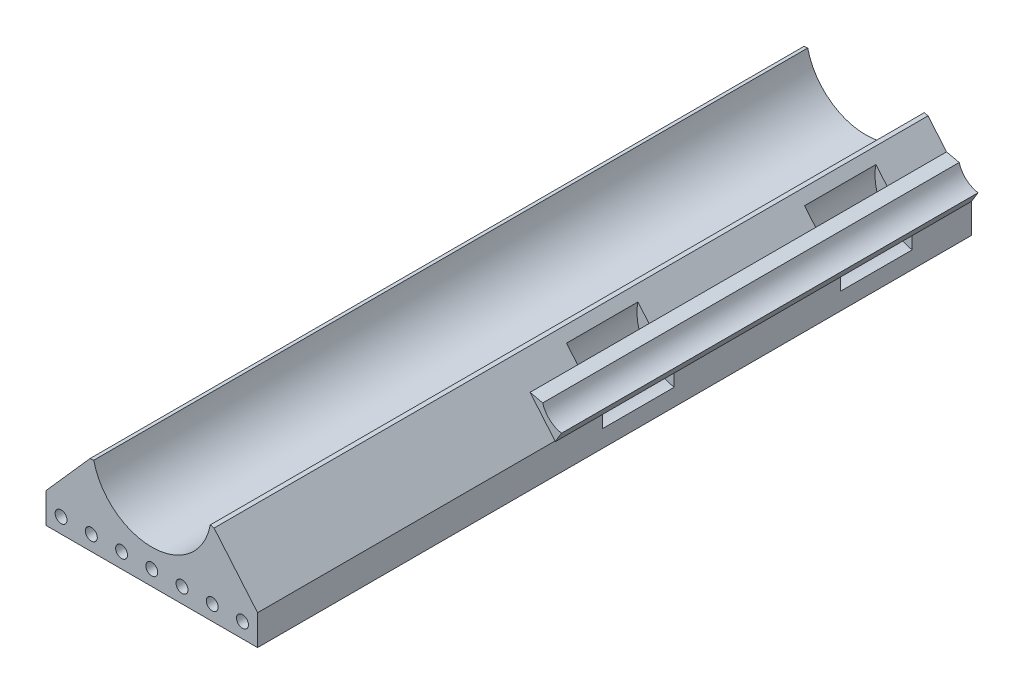
ISO-10303-21;
HEADER;
FILE_DESCRIPTION(('STEP AP214'),'2;1');
FILE_NAME('part.step','',(''),(''),'','','');
FILE_SCHEMA(('AUTOMOTIVE_DESIGN { 1 0 10303 214 1 1 1 1 }'));
ENDSEC;
DATA;
#1=APPLICATION_CONTEXT('core data for automotive mechanical design processes');
#2=APPLICATION_PROTOCOL_DEFINITION('international standard','automotive_design',2000,#1);
#3=PRODUCT_CONTEXT('',#1,'mechanical');
#4=PRODUCT('Part','Part','',(#3));
#5=PRODUCT_RELATED_PRODUCT_CATEGORY('part','',(#4));
#6=PRODUCT_DEFINITION_FORMATION('','',#4);
#7=PRODUCT_DEFINITION_CONTEXT('part definition',#1,'design');
#8=PRODUCT_DEFINITION('design','',#6,#7);
#9=PRODUCT_DEFINITION_SHAPE('','',#8);
#10=(LENGTH_UNIT() NAMED_UNIT(*) SI_UNIT(.MILLI.,.METRE.));
#11=(NAMED_UNIT(*) PLANE_ANGLE_UNIT() SI_UNIT($,.RADIAN.));
#12=(NAMED_UNIT(*) SI_UNIT($,.STERADIAN.) SOLID_ANGLE_UNIT());
#13=UNCERTAINTY_MEASURE_WITH_UNIT(LENGTH_MEASURE(1.E-05),#10,'distance_accuracy_value','');
#14=(GEOMETRIC_REPRESENTATION_CONTEXT(3) GLOBAL_UNCERTAINTY_ASSIGNED_CONTEXT((#13)) GLOBAL_UNIT_ASSIGNED_CONTEXT((#10,
#11,#12)) REPRESENTATION_CONTEXT('',''));
#15=CARTESIAN_POINT('',(0.,0.,0.));
#16=DIRECTION('',(0.,0.,1.));
#17=DIRECTION('',(1.,0.,0.));
#18=AXIS2_PLACEMENT_3D('',#15,#16,#17);
#19=CARTESIAN_POINT('',(2.56876196961471,2.1667272725822,60.));
#20=DIRECTION('',(0.764389099827261,0.644755228024767,0.));
#21=DIRECTION('',(-0.644755228024767,0.764389099827261,0.));
#22=AXIS2_PLACEMENT_3D('',#19,#20,#21);
#23=PLANE('',#22);
#24=DIRECTION('',(0.644755228024768,-0.76438909982726,0.));
#25=VECTOR('',#24,1.);
#26=CARTESIAN_POINT('',(309999.846884956,-367514.884819966,25.));
#27=LINE('',#26,#25);
#28=CARTESIAN_POINT('',(5.85347357839738,-1.72746022781489,25.));
#29=VERTEX_POINT('',#28);
#30=CARTESIAN_POINT('',(6.7900058250499,-2.83776536362719,25.));
#31=VERTEX_POINT('',#30);
#32=EDGE_CURVE('E364',#29,#31,#27,.T.);
#33=ORIENTED_EDGE('',*,*,#32,.T.);
#34=DIRECTION('',(0.,0.,-1.));
#35=VECTOR('',#34,1.);
#36=CARTESIAN_POINT('',(6.7900058250499,-2.83776536362719,35.));
#37=LINE('',#36,#35);
#38=CARTESIAN_POINT('',(6.7900058250499,-2.83776536362719,11.));
#39=VERTEX_POINT('',#38);
#40=EDGE_CURVE('E199',#31,#39,#37,.T.);
#41=ORIENTED_EDGE('',*,*,#40,.T.);
#42=DIRECTION('',(0.644755228024768,-0.76438909982726,0.));
#43=VECTOR('',#42,1.);
#44=CARTESIAN_POINT('',(309999.846884956,-367514.884819966,11.));
#45=LINE('',#44,#43);
#46=CARTESIAN_POINT('',(5.8534735783453,-1.72746022781489,11.));
#47=VERTEX_POINT('',#46);
#48=EDGE_CURVE('E325',#47,#39,#45,.T.);
#49=ORIENTED_EDGE('',*,*,#48,.F.);
#50=DIRECTION('',(0.,0.,1.));
#51=VECTOR('',#50,1.);
#52=CARTESIAN_POINT('',(5.85347357839738,-1.72746022781489,5.));
#53=LINE('',#52,#51);
#54=CARTESIAN_POINT('',(5.85347357839738,-1.72746022781489,5.));
#55=VERTEX_POINT('',#54);
#56=EDGE_CURVE('E317',#55,#47,#53,.T.);
#57=ORIENTED_EDGE('',*,*,#56,.F.);
#58=DIRECTION('',(0.644755228024768,-0.76438909982726,0.));
#59=VECTOR('',#58,1.);
#60=CARTESIAN_POINT('',(309999.846884956,-367514.884819966,5.));
#61=LINE('',#60,#59);
#62=CARTESIAN_POINT('',(6.7900058250499,-2.83776536362719,5.));
#63=VERTEX_POINT('',#62);
#64=EDGE_CURVE('E336',#55,#63,#61,.T.);
#65=ORIENTED_EDGE('',*,*,#64,.T.);
#66=CARTESIAN_POINT('',(6.7900058250499,-2.83776536362719,0.));
#67=VERTEX_POINT('',#66);
#68=EDGE_CURVE('E201',#63,#67,#37,.T.);
#69=ORIENTED_EDGE('',*,*,#68,.T.);
#70=DIRECTION('',(0.644755228024767,-0.764389099827261,0.));
#71=VECTOR('',#70,1.);
#72=CARTESIAN_POINT('',(2.56876196961471,2.1667272725822,0.));
#73=LINE('',#72,#71);
#74=CARTESIAN_POINT('',(5.23403324041858,-0.993083177852738,0.));
#75=VERTEX_POINT('',#74);
#76=EDGE_CURVE('E266',#75,#67,#73,.T.);
#77=ORIENTED_EDGE('',*,*,#76,.F.);
#78=DIRECTION('',(0.,0.,-1.));
#79=VECTOR('',#78,1.);
#80=CARTESIAN_POINT('',(5.23403324041858,-0.993083177852738,60.));
#81=LINE('',#80,#79);
#82=CARTESIAN_POINT('',(5.23403324041858,-0.993083177852738,60.));
#83=VERTEX_POINT('',#82);
#84=EDGE_CURVE('E210',#83,#75,#81,.T.);
#85=ORIENTED_EDGE('',*,*,#84,.F.);
#86=DIRECTION('',(0.644755228024767,-0.764389099827261,0.));
#87=VECTOR('',#86,1.);
#88=CARTESIAN_POINT('',(2.56876196961471,2.1667272725822,60.));
#89=LINE('',#88,#87);
#90=CARTESIAN_POINT('',(8.89,-5.32741195703323,60.));
#91=VERTEX_POINT('',#90);
#92=EDGE_CURVE('E207',#83,#91,#89,.T.);
#93=ORIENTED_EDGE('',*,*,#92,.T.);
#94=DIRECTION('',(0.,0.,-1.));
#95=VECTOR('',#94,1.);
#96=CARTESIAN_POINT('',(8.89,-5.32741195703323,60.));
#97=LINE('',#96,#95);
#98=CARTESIAN_POINT('',(8.89,-5.32741195703323,35.));
#99=VERTEX_POINT('',#98);
#100=EDGE_CURVE('E49',#91,#99,#97,.T.);
#101=ORIENTED_EDGE('',*,*,#100,.T.);
#102=DIRECTION('',(0.644755228024767,-0.764389099827261,0.));
#103=VECTOR('',#102,1.);
#104=CARTESIAN_POINT('',(2.56876196961471,2.1667272725822,35.));
#105=LINE('',#104,#103);
#106=CARTESIAN_POINT('',(6.7900058250499,-2.83776536362719,35.));
#107=VERTEX_POINT('',#106);
#108=EDGE_CURVE('E11',#107,#99,#105,.T.);
#109=ORIENTED_EDGE('',*,*,#108,.F.);
#110=CARTESIAN_POINT('',(6.7900058250499,-2.83776536362719,31.));
#111=VERTEX_POINT('',#110);
#112=EDGE_CURVE('E191',#107,#111,#37,.T.);
#113=ORIENTED_EDGE('',*,*,#112,.T.);
#114=DIRECTION('',(0.644755228024768,-0.76438909982726,0.));
#115=VECTOR('',#114,1.);
#116=CARTESIAN_POINT('',(309999.846884956,-367514.884819966,31.));
#117=LINE('',#116,#115);
#118=CARTESIAN_POINT('',(5.8534735783453,-1.72746022781489,31.));
#119=VERTEX_POINT('',#118);
#120=EDGE_CURVE('E355',#119,#111,#117,.T.);
#121=ORIENTED_EDGE('',*,*,#120,.F.);
#122=DIRECTION('',(0.,0.,1.));
#123=VECTOR('',#122,1.);
#124=CARTESIAN_POINT('',(5.85347357839738,-1.72746022781489,25.));
#125=LINE('',#124,#123);
#126=EDGE_CURVE('E64',#29,#119,#125,.T.);
#127=ORIENTED_EDGE('',*,*,#126,.F.);
#128=EDGE_LOOP('',(#33,#41,#49,#57,#65,#69,#77,#85,#93,#101,#109,#113,#121,#127));
#129=FACE_BOUND('',#128,.T.);
#130=ADVANCED_FACE('F41',(#129),#23,.T.);
#131=CARTESIAN_POINT('',(8.89,0.,60.));
#132=DIRECTION('',(-1.,0.,0.));
#133=DIRECTION('',(0.,0.,1.));
#134=AXIS2_PLACEMENT_3D('',#131,#132,#133);
#135=PLANE('',#134);
#136=DIRECTION('',(0.,1.,0.));
#137=VECTOR('',#136,1.);
#138=CARTESIAN_POINT('',(8.89,0.,0.));
#139=LINE('',#138,#137);
#140=CARTESIAN_POINT('',(8.89,-7.86741195703324,0.));
#141=VERTEX_POINT('',#140);
#142=CARTESIAN_POINT('',(8.89,-5.39033993172947,0.));
#143=VERTEX_POINT('',#142);
#144=EDGE_CURVE('E269',#141,#143,#139,.T.);
#145=ORIENTED_EDGE('',*,*,#144,.T.);
#146=DIRECTION('',(0.,0.,-1.));
#147=VECTOR('',#146,1.);
#148=CARTESIAN_POINT('',(8.89,-5.39033993172947,35.));
#149=LINE('',#148,#147);
#150=CARTESIAN_POINT('',(8.89,-5.39033993172947,5.));
#151=VERTEX_POINT('',#150);
#152=EDGE_CURVE('E374',#151,#143,#149,.T.);
#153=ORIENTED_EDGE('',*,*,#152,.F.);
#154=DIRECTION('',(0.,1.,0.));
#155=VECTOR('',#154,1.);
#156=CARTESIAN_POINT('',(8.89000000051965,-291600.577228365,5.));
#157=LINE('',#156,#155);
#158=CARTESIAN_POINT('',(8.89000000003232,-6.42459297068077,5.));
#159=VERTEX_POINT('',#158);
#160=EDGE_CURVE('E324',#159,#151,#157,.T.);
#161=ORIENTED_EDGE('',*,*,#160,.F.);
#162=DIRECTION('',(0.,0.,1.));
#163=VECTOR('',#162,1.);
#164=CARTESIAN_POINT('',(8.89000000003232,-6.42459297068077,5.));
#165=LINE('',#164,#163);
#166=CARTESIAN_POINT('',(8.89000000003232,-6.42459297068077,11.));
#167=VERTEX_POINT('',#166);
#168=EDGE_CURVE('E272',#159,#167,#165,.T.);
#169=ORIENTED_EDGE('',*,*,#168,.T.);
#170=DIRECTION('',(0.,1.,0.));
#171=VECTOR('',#170,1.);
#172=CARTESIAN_POINT('',(8.89000000051965,-291600.577228365,11.));
#173=LINE('',#172,#171);
#174=CARTESIAN_POINT('',(8.89,-5.39033993172947,11.));
#175=VERTEX_POINT('',#174);
#176=EDGE_CURVE('E331',#167,#175,#173,.T.);
#177=ORIENTED_EDGE('',*,*,#176,.T.);
#178=CARTESIAN_POINT('',(8.89,-5.39033993172947,25.));
#179=VERTEX_POINT('',#178);
#180=EDGE_CURVE('E373',#179,#175,#149,.T.);
#181=ORIENTED_EDGE('',*,*,#180,.F.);
#182=DIRECTION('',(0.,1.,0.));
#183=VECTOR('',#182,1.);
#184=CARTESIAN_POINT('',(8.89000000051965,-291600.577228365,25.));
#185=LINE('',#184,#183);
#186=CARTESIAN_POINT('',(8.89000000003232,-6.42459297068077,25.));
#187=VERTEX_POINT('',#186);
#188=EDGE_CURVE('E354',#187,#179,#185,.T.);
#189=ORIENTED_EDGE('',*,*,#188,.F.);
#190=DIRECTION('',(0.,0.,1.));
#191=VECTOR('',#190,1.);
#192=CARTESIAN_POINT('',(8.89000000003232,-6.42459297068077,25.));
#193=LINE('',#192,#191);
#194=CARTESIAN_POINT('',(8.89000000003232,-6.42459297068077,31.));
#195=VERTEX_POINT('',#194);
#196=EDGE_CURVE('E334',#187,#195,#193,.T.);
#197=ORIENTED_EDGE('',*,*,#196,.T.);
#198=DIRECTION('',(0.,1.,0.));
#199=VECTOR('',#198,1.);
#200=CARTESIAN_POINT('',(8.89000000051965,-291600.577228365,31.));
#201=LINE('',#200,#199);
#202=CARTESIAN_POINT('',(8.89,-5.3903399317399,31.));
#203=VERTEX_POINT('',#202);
#204=EDGE_CURVE('E360',#195,#203,#201,.T.);
#205=ORIENTED_EDGE('',*,*,#204,.T.);
#206=CARTESIAN_POINT('',(8.89,-5.39033993172947,35.));
#207=VERTEX_POINT('',#206);
#208=EDGE_CURVE('E56',#207,#203,#149,.T.);
#209=ORIENTED_EDGE('',*,*,#208,.F.);
#210=DIRECTION('',(0.,1.,0.));
#211=VECTOR('',#210,1.);
#212=CARTESIAN_POINT('',(8.89,0.,35.));
#213=LINE('',#212,#211);
#214=EDGE_CURVE('E198',#207,#99,#213,.T.);
#215=ORIENTED_EDGE('',*,*,#214,.T.);
#216=ORIENTED_EDGE('',*,*,#100,.F.);
#217=DIRECTION('',(0.,1.,0.));
#218=VECTOR('',#217,1.);
#219=CARTESIAN_POINT('',(8.89,0.,60.));
#220=LINE('',#219,#218);
#221=CARTESIAN_POINT('',(8.89,-7.86741195703324,60.));
#222=VERTEX_POINT('',#221);
#223=EDGE_CURVE('E230',#222,#91,#220,.T.);
#224=ORIENTED_EDGE('',*,*,#223,.F.);
#225=DIRECTION('',(0.,0.,-1.));
#226=VECTOR('',#225,1.);
#227=CARTESIAN_POINT('',(8.89,-7.86741195703324,60.));
#228=LINE('',#227,#226);
#229=EDGE_CURVE('E223',#222,#141,#228,.T.);
#230=ORIENTED_EDGE('',*,*,#229,.T.);
#231=EDGE_LOOP('',(#145,#153,#161,#169,#177,#181,#189,#197,#205,#209,#215,#216,#224,#230));
#232=FACE_BOUND('',#231,.T.);
#233=ADVANCED_FACE('F43',(#232),#135,.F.);
#234=CARTESIAN_POINT('',(0.0266361172852631,0.124150275090104,60.));
#235=DIRECTION('',(0.209773701476051,0.977749965057037,0.));
#236=DIRECTION('',(-0.977749965057037,0.209773701476051,0.));
#237=AXIS2_PLACEMENT_3D('',#234,#235,#236);
#238=PLANE('',#237);
#239=DIRECTION('',(0.977749965057037,-0.209773701476051,0.));
#240=VECTOR('',#239,1.);
#241=CARTESIAN_POINT('',(0.0266361172852631,0.124150275090104,0.));
#242=LINE('',#241,#240);
#243=CARTESIAN_POINT('',(4.91380928420098,-0.924379964354641,0.));
#244=VERTEX_POINT('',#243);
#245=EDGE_CURVE('E263',#244,#75,#242,.T.);
#246=ORIENTED_EDGE('',*,*,#245,.F.);
#247=DIRECTION('',(0.,0.,-1.));
#248=VECTOR('',#247,1.);
#249=CARTESIAN_POINT('',(4.91380928420098,-0.924379964354641,60.));
#250=LINE('',#249,#248);
#251=CARTESIAN_POINT('',(4.91380928420098,-0.924379964354641,60.));
#252=VERTEX_POINT('',#251);
#253=EDGE_CURVE('E211',#252,#244,#250,.T.);
#254=ORIENTED_EDGE('',*,*,#253,.F.);
#255=DIRECTION('',(0.977749965057037,-0.209773701476051,0.));
#256=VECTOR('',#255,1.);
#257=CARTESIAN_POINT('',(0.0266361172852631,0.124150275090104,60.));
#258=LINE('',#257,#256);
#259=EDGE_CURVE('E306',#252,#83,#258,.T.);
#260=ORIENTED_EDGE('',*,*,#259,.T.);
#261=ORIENTED_EDGE('',*,*,#84,.T.);
#262=EDGE_LOOP('',(#246,#254,#260,#261));
#263=FACE_BOUND('',#262,.T.);
#264=ADVANCED_FACE('F433',(#263),#238,.T.);
#265=CARTESIAN_POINT('',(0.,0.,60.));
#266=DIRECTION('',(0.,0.,-1.));
#267=DIRECTION('',(-1.,0.,0.));
#268=AXIS2_PLACEMENT_3D('',#265,#266,#267);
#269=CYLINDRICAL_SURFACE('',#268,5.);
#270=CARTESIAN_POINT('',(0.,0.,0.));
#271=DIRECTION('',(0.,0.,1.));
#272=DIRECTION('',(1.,0.,0.));
#273=AXIS2_PLACEMENT_3D('',#270,#271,#272);
#274=CIRCLE('',#273,5.);
#275=CARTESIAN_POINT('',(-4.87518967537907,-1.11019170825464,0.));
#276=VERTEX_POINT('',#275);
#277=EDGE_CURVE('E260',#276,#244,#274,.T.);
#278=ORIENTED_EDGE('',*,*,#277,.F.);
#279=DIRECTION('',(0.,0.,-1.));
#280=VECTOR('',#279,1.);
#281=CARTESIAN_POINT('',(-4.87518967537907,-1.11019170825464,60.));
#282=LINE('',#281,#280);
#283=CARTESIAN_POINT('',(-4.87518967537907,-1.11019170825464,60.));
#284=VERTEX_POINT('',#283);
#285=EDGE_CURVE('E215',#284,#276,#282,.T.);
#286=ORIENTED_EDGE('',*,*,#285,.F.);
#287=CARTESIAN_POINT('',(0.,0.,60.));
#288=DIRECTION('',(0.,0.,1.));
#289=DIRECTION('',(1.,0.,0.));
#290=AXIS2_PLACEMENT_3D('',#287,#288,#289);
#291=CIRCLE('',#290,5.);
#292=EDGE_CURVE('E303',#284,#252,#291,.T.);
#293=ORIENTED_EDGE('',*,*,#292,.T.);
#294=ORIENTED_EDGE('',*,*,#253,.T.);
#295=EDGE_LOOP('',(#278,#286,#293,#294));
#296=FACE_BOUND('',#295,.T.);
#297=ADVANCED_FACE('F429',(#296),#269,.F.);
#298=CARTESIAN_POINT('',(0.0579770681921691,-0.406365014776598,60.));
#299=DIRECTION('',(-0.141242111976336,0.989975083426075,0.));
#300=DIRECTION('',(-0.989975083426075,-0.141242111976336,0.));
#301=AXIS2_PLACEMENT_3D('',#298,#299,#300);
#302=PLANE('',#301);
#303=DIRECTION('',(0.989975083426075,0.141242111976336,0.));
#304=VECTOR('',#303,1.);
#305=CARTESIAN_POINT('',(0.0579770681921691,-0.406365014776598,0.));
#306=LINE('',#305,#304);
#307=CARTESIAN_POINT('',(-5.20034939883361,-1.15658302338898,0.));
#308=VERTEX_POINT('',#307);
#309=EDGE_CURVE('E257',#308,#276,#306,.T.);
#310=ORIENTED_EDGE('',*,*,#309,.F.);
#311=DIRECTION('',(0.,0.,-1.));
#312=VECTOR('',#311,1.);
#313=CARTESIAN_POINT('',(-5.20034939883361,-1.15658302338898,60.));
#314=LINE('',#313,#312);
#315=CARTESIAN_POINT('',(-5.20034939883361,-1.15658302338898,60.));
#316=VERTEX_POINT('',#315);
#317=EDGE_CURVE('E217',#316,#308,#314,.T.);
#318=ORIENTED_EDGE('',*,*,#317,.F.);
#319=DIRECTION('',(0.989975083426075,0.141242111976336,0.));
#320=VECTOR('',#319,1.);
#321=CARTESIAN_POINT('',(0.0579770681921691,-0.406365014776598,60.));
#322=LINE('',#321,#320);
#323=EDGE_CURVE('E300',#316,#284,#322,.T.);
#324=ORIENTED_EDGE('',*,*,#323,.T.);
#325=ORIENTED_EDGE('',*,*,#285,.T.);
#326=EDGE_LOOP('',(#310,#318,#324,#325));
#327=FACE_BOUND('',#326,.T.);
#328=ADVANCED_FACE('F424',(#327),#302,.T.);
#329=CARTESIAN_POINT('',(-2.34335136006175,2.07300464534789,60.));
#330=DIRECTION('',(0.748990220795016,-0.662581051006919,0.));
#331=DIRECTION('',(0.662581051006919,0.748990220795016,0.));
#332=AXIS2_PLACEMENT_3D('',#329,#330,#331);
#333=PLANE('',#332);
#334=DIRECTION('',(-0.662581051006919,-0.748990220795016,0.));
#335=VECTOR('',#334,1.);
#336=CARTESIAN_POINT('',(-2.34335136006175,2.07300464534789,0.));
#337=LINE('',#336,#335);
#338=CARTESIAN_POINT('',(-8.89,-5.32741195703323,0.));
#339=VERTEX_POINT('',#338);
#340=EDGE_CURVE('E254',#308,#339,#337,.T.);
#341=ORIENTED_EDGE('',*,*,#340,.T.);
#342=DIRECTION('',(0.,0.,-1.));
#343=VECTOR('',#342,1.);
#344=CARTESIAN_POINT('',(-8.89,-5.32741195703323,60.));
#345=LINE('',#344,#343);
#346=CARTESIAN_POINT('',(-8.89,-5.32741195703323,60.));
#347=VERTEX_POINT('',#346);
#348=EDGE_CURVE('E219',#347,#339,#345,.T.);
#349=ORIENTED_EDGE('',*,*,#348,.F.);
#350=DIRECTION('',(-0.662581051006919,-0.748990220795016,0.));
#351=VECTOR('',#350,1.);
#352=CARTESIAN_POINT('',(-2.34335136006175,2.07300464534789,60.));
#353=LINE('',#352,#351);
#354=EDGE_CURVE('E298',#316,#347,#353,.T.);
#355=ORIENTED_EDGE('',*,*,#354,.F.);
#356=ORIENTED_EDGE('',*,*,#317,.T.);
#357=EDGE_LOOP('',(#341,#349,#355,#356));
#358=FACE_BOUND('',#357,.T.);
#359=ADVANCED_FACE('F421',(#358),#333,.F.);
#360=CARTESIAN_POINT('',(-8.89,0.,60.));
#361=DIRECTION('',(-1.,0.,0.));
#362=DIRECTION('',(0.,0.,1.));
#363=AXIS2_PLACEMENT_3D('',#360,#361,#362);
#364=PLANE('',#363);
#365=DIRECTION('',(0.,1.,0.));
#366=VECTOR('',#365,1.);
#367=CARTESIAN_POINT('',(-8.89,0.,0.));
#368=LINE('',#367,#366);
#369=CARTESIAN_POINT('',(-8.89,-7.86741195703324,0.));
#370=VERTEX_POINT('',#369);
#371=EDGE_CURVE('E251',#370,#339,#368,.T.);
#372=ORIENTED_EDGE('',*,*,#371,.F.);
#373=DIRECTION('',(0.,0.,-1.));
#374=VECTOR('',#373,1.);
#375=CARTESIAN_POINT('',(-8.89,-7.86741195703324,60.));
#376=LINE('',#375,#374);
#377=CARTESIAN_POINT('',(-8.89,-7.86741195703324,60.));
#378=VERTEX_POINT('',#377);
#379=EDGE_CURVE('E221',#378,#370,#376,.T.);
#380=ORIENTED_EDGE('',*,*,#379,.F.);
#381=DIRECTION('',(0.,1.,0.));
#382=VECTOR('',#381,1.);
#383=CARTESIAN_POINT('',(-8.89,0.,60.));
#384=LINE('',#383,#382);
#385=EDGE_CURVE('E295',#378,#347,#384,.T.);
#386=ORIENTED_EDGE('',*,*,#385,.T.);
#387=ORIENTED_EDGE('',*,*,#348,.T.);
#388=EDGE_LOOP('',(#372,#380,#386,#387));
#389=FACE_BOUND('',#388,.T.);
#390=ADVANCED_FACE('F417',(#389),#364,.T.);
#391=CARTESIAN_POINT('',(-5.08,-6.59741195703324,60.));
#392=DIRECTION('',(0.,0.,-1.));
#393=DIRECTION('',(-1.,0.,0.));
#394=AXIS2_PLACEMENT_3D('',#391,#392,#393);
#395=CYLINDRICAL_SURFACE('',#394,0.500000000000001);
#396=CARTESIAN_POINT('',(-5.08,-6.59741195703324,60.));
#397=DIRECTION('',(0.,0.,1.));
#398=DIRECTION('',(1.,0.,0.));
#399=AXIS2_PLACEMENT_3D('',#396,#397,#398);
#400=CIRCLE('',#399,0.500000000000001);
#401=CARTESIAN_POINT('',(-4.58,-6.59741195703324,60.));
#402=VERTEX_POINT('',#401);
#403=EDGE_CURVE('E275',#402,#402,#400,.T.);
#404=ORIENTED_EDGE('',*,*,#403,.T.);
#405=EDGE_LOOP('',(#404));
#406=FACE_BOUND('',#405,.T.);
#407=CARTESIAN_POINT('',(-5.08,-6.59741195703324,0.));
#408=DIRECTION('',(0.,0.,1.));
#409=DIRECTION('',(1.,0.,0.));
#410=AXIS2_PLACEMENT_3D('',#407,#408,#409);
#411=CIRCLE('',#410,0.500000000000001);
#412=CARTESIAN_POINT('',(-4.58,-6.59741195703324,0.));
#413=VERTEX_POINT('',#412);
#414=EDGE_CURVE('E231',#413,#413,#411,.T.);
#415=ORIENTED_EDGE('',*,*,#414,.F.);
#416=EDGE_LOOP('',(#415));
#417=FACE_BOUND('',#416,.T.);
#418=ADVANCED_FACE('F477',(#406,#417),#395,.F.);
#419=CARTESIAN_POINT('',(-2.54,-6.59741195703324,60.));
#420=DIRECTION('',(0.,0.,-1.));
#421=DIRECTION('',(-1.,0.,0.));
#422=AXIS2_PLACEMENT_3D('',#419,#420,#421);
#423=CYLINDRICAL_SURFACE('',#422,0.5);
#424=CARTESIAN_POINT('',(-2.54,-6.59741195703324,60.));
#425=DIRECTION('',(0.,0.,1.));
#426=DIRECTION('',(1.,0.,0.));
#427=AXIS2_PLACEMENT_3D('',#424,#425,#426);
#428=CIRCLE('',#427,0.5);
#429=CARTESIAN_POINT('',(-2.04,-6.59741195703324,60.));
#430=VERTEX_POINT('',#429);
#431=EDGE_CURVE('E278',#430,#430,#428,.T.);
#432=ORIENTED_EDGE('',*,*,#431,.T.);
#433=EDGE_LOOP('',(#432));
#434=FACE_BOUND('',#433,.T.);
#435=CARTESIAN_POINT('',(-2.54,-6.59741195703324,0.));
#436=DIRECTION('',(0.,0.,1.));
#437=DIRECTION('',(1.,0.,0.));
#438=AXIS2_PLACEMENT_3D('',#435,#436,#437);
#439=CIRCLE('',#438,0.5);
#440=CARTESIAN_POINT('',(-2.04,-6.59741195703324,0.));
#441=VERTEX_POINT('',#440);
#442=EDGE_CURVE('E234',#441,#441,#439,.T.);
#443=ORIENTED_EDGE('',*,*,#442,.F.);
#444=EDGE_LOOP('',(#443));
#445=FACE_BOUND('',#444,.T.);
#446=ADVANCED_FACE('F496',(#434,#445),#423,.F.);
#447=CARTESIAN_POINT('',(0.,-6.59741195703324,60.));
#448=DIRECTION('',(0.,0.,-1.));
#449=DIRECTION('',(-1.,0.,0.));
#450=AXIS2_PLACEMENT_3D('',#447,#448,#449);
#451=CYLINDRICAL_SURFACE('',#450,0.500000000000001);
#452=CARTESIAN_POINT('',(0.,-6.59741195703324,60.));
#453=DIRECTION('',(0.,0.,1.));
#454=DIRECTION('',(1.,0.,0.));
#455=AXIS2_PLACEMENT_3D('',#452,#453,#454);
#456=CIRCLE('',#455,0.500000000000001);
#457=CARTESIAN_POINT('',(0.500000000000001,-6.59741195703324,60.));
#458=VERTEX_POINT('',#457);
#459=EDGE_CURVE('E281',#458,#458,#456,.T.);
#460=ORIENTED_EDGE('',*,*,#459,.T.);
#461=EDGE_LOOP('',(#460));
#462=FACE_BOUND('',#461,.T.);
#463=CARTESIAN_POINT('',(0.,-6.59741195703324,0.));
#464=DIRECTION('',(0.,0.,1.));
#465=DIRECTION('',(1.,0.,0.));
#466=AXIS2_PLACEMENT_3D('',#463,#464,#465);
#467=CIRCLE('',#466,0.500000000000001);
#468=CARTESIAN_POINT('',(0.500000000000001,-6.59741195703324,0.));
#469=VERTEX_POINT('',#468);
#470=EDGE_CURVE('E237',#469,#469,#467,.T.);
#471=ORIENTED_EDGE('',*,*,#470,.F.);
#472=EDGE_LOOP('',(#471));
#473=FACE_BOUND('',#472,.T.);
#474=ADVANCED_FACE('F492',(#462,#473),#451,.F.);
#475=CARTESIAN_POINT('',(2.54,-6.59741195703324,60.));
#476=DIRECTION('',(0.,0.,-1.));
#477=DIRECTION('',(-1.,0.,0.));
#478=AXIS2_PLACEMENT_3D('',#475,#476,#477);
#479=CYLINDRICAL_SURFACE('',#478,0.5);
#480=CARTESIAN_POINT('',(2.54,-6.59741195703324,60.));
#481=DIRECTION('',(0.,0.,1.));
#482=DIRECTION('',(1.,0.,0.));
#483=AXIS2_PLACEMENT_3D('',#480,#481,#482);
#484=CIRCLE('',#483,0.5);
#485=CARTESIAN_POINT('',(3.04,-6.59741195703324,60.));
#486=VERTEX_POINT('',#485);
#487=EDGE_CURVE('E284',#486,#486,#484,.T.);
#488=ORIENTED_EDGE('',*,*,#487,.T.);
#489=EDGE_LOOP('',(#488));
#490=FACE_BOUND('',#489,.T.);
#491=CARTESIAN_POINT('',(2.54,-6.59741195703324,0.));
#492=DIRECTION('',(0.,0.,1.));
#493=DIRECTION('',(1.,0.,0.));
#494=AXIS2_PLACEMENT_3D('',#491,#492,#493);
#495=CIRCLE('',#494,0.5);
#496=CARTESIAN_POINT('',(3.04,-6.59741195703324,0.));
#497=VERTEX_POINT('',#496);
#498=EDGE_CURVE('E240',#497,#497,#495,.T.);
#499=ORIENTED_EDGE('',*,*,#498,.F.);
#500=EDGE_LOOP('',(#499));
#501=FACE_BOUND('',#500,.T.);
#502=ADVANCED_FACE('F488',(#490,#501),#479,.F.);
#503=CARTESIAN_POINT('',(5.08,-6.59741195703324,60.));
#504=DIRECTION('',(0.,0.,-1.));
#505=DIRECTION('',(-1.,0.,0.));
#506=AXIS2_PLACEMENT_3D('',#503,#504,#505);
#507=CYLINDRICAL_SURFACE('',#506,0.500000000000001);
#508=CARTESIAN_POINT('',(5.08,-6.59741195703324,60.));
#509=DIRECTION('',(0.,0.,1.));
#510=DIRECTION('',(1.,0.,0.));
#511=AXIS2_PLACEMENT_3D('',#508,#509,#510);
#512=CIRCLE('',#511,0.500000000000001);
#513=CARTESIAN_POINT('',(5.58,-6.59741195703324,60.));
#514=VERTEX_POINT('',#513);
#515=EDGE_CURVE('E287',#514,#514,#512,.T.);
#516=ORIENTED_EDGE('',*,*,#515,.T.);
#517=EDGE_LOOP('',(#516));
#518=FACE_BOUND('',#517,.T.);
#519=CARTESIAN_POINT('',(5.08,-6.59741195703324,0.));
#520=DIRECTION('',(0.,0.,1.));
#521=DIRECTION('',(1.,0.,0.));
#522=AXIS2_PLACEMENT_3D('',#519,#520,#521);
#523=CIRCLE('',#522,0.500000000000001);
#524=CARTESIAN_POINT('',(5.58,-6.59741195703324,0.));
#525=VERTEX_POINT('',#524);
#526=EDGE_CURVE('E243',#525,#525,#523,.T.);
#527=ORIENTED_EDGE('',*,*,#526,.F.);
#528=EDGE_LOOP('',(#527));
#529=FACE_BOUND('',#528,.T.);
#530=ADVANCED_FACE('F484',(#518,#529),#507,.F.);
#531=CARTESIAN_POINT('',(7.62,-6.59741195703324,60.));
#532=DIRECTION('',(0.,0.,-1.));
#533=DIRECTION('',(-1.,0.,0.));
#534=AXIS2_PLACEMENT_3D('',#531,#532,#533);
#535=CYLINDRICAL_SURFACE('',#534,0.500000000000001);
#536=CARTESIAN_POINT('',(7.62,-6.59741195703324,60.));
#537=DIRECTION('',(0.,0.,1.));
#538=DIRECTION('',(1.,0.,0.));
#539=AXIS2_PLACEMENT_3D('',#536,#537,#538);
#540=CIRCLE('',#539,0.500000000000001);
#541=CARTESIAN_POINT('',(8.12,-6.59741195703324,60.));
#542=VERTEX_POINT('',#541);
#543=EDGE_CURVE('E290',#542,#542,#540,.T.);
#544=ORIENTED_EDGE('',*,*,#543,.T.);
#545=EDGE_LOOP('',(#544));
#546=FACE_BOUND('',#545,.T.);
#547=CARTESIAN_POINT('',(7.62,-6.59741195703324,0.));
#548=DIRECTION('',(0.,0.,1.));
#549=DIRECTION('',(1.,0.,0.));
#550=AXIS2_PLACEMENT_3D('',#547,#548,#549);
#551=CIRCLE('',#550,0.500000000000001);
#552=CARTESIAN_POINT('',(8.12,-6.59741195703324,0.));
#553=VERTEX_POINT('',#552);
#554=EDGE_CURVE('E246',#553,#553,#551,.T.);
#555=ORIENTED_EDGE('',*,*,#554,.F.);
#556=EDGE_LOOP('',(#555));
#557=FACE_BOUND('',#556,.T.);
#558=ADVANCED_FACE('F481',(#546,#557),#535,.F.);
#559=CARTESIAN_POINT('',(0.,-7.86741195703324,60.));
#560=DIRECTION('',(0.,1.,0.));
#561=DIRECTION('',(0.,0.,1.));
#562=AXIS2_PLACEMENT_3D('',#559,#560,#561);
#563=PLANE('',#562);
#564=DIRECTION('',(1.,0.,0.));
#565=VECTOR('',#564,1.);
#566=CARTESIAN_POINT('',(0.,-7.86741195703324,0.));
#567=LINE('',#566,#565);
#568=EDGE_CURVE('E249',#370,#141,#567,.T.);
#569=ORIENTED_EDGE('',*,*,#568,.T.);
#570=ORIENTED_EDGE('',*,*,#229,.F.);
#571=DIRECTION('',(1.,0.,0.));
#572=VECTOR('',#571,1.);
#573=CARTESIAN_POINT('',(0.,-7.86741195703324,60.));
#574=LINE('',#573,#572);
#575=EDGE_CURVE('E293',#378,#222,#574,.T.);
#576=ORIENTED_EDGE('',*,*,#575,.F.);
#577=ORIENTED_EDGE('',*,*,#379,.T.);
#578=EDGE_LOOP('',(#569,#570,#576,#577));
#579=FACE_BOUND('',#578,.T.);
#580=ADVANCED_FACE('F412',(#579),#563,.F.);
#581=CARTESIAN_POINT('',(-7.62,-6.59741195703324,60.));
#582=DIRECTION('',(0.,0.,-1.));
#583=DIRECTION('',(-1.,0.,0.));
#584=AXIS2_PLACEMENT_3D('',#581,#582,#583);
#585=CYLINDRICAL_SURFACE('',#584,0.500000000000001);
#586=CARTESIAN_POINT('',(-7.62,-6.59741195703324,60.));
#587=DIRECTION('',(0.,0.,1.));
#588=DIRECTION('',(1.,0.,0.));
#589=AXIS2_PLACEMENT_3D('',#586,#587,#588);
#590=CIRCLE('',#589,0.500000000000001);
#591=CARTESIAN_POINT('',(-7.12,-6.59741195703324,60.));
#592=VERTEX_POINT('',#591);
#593=EDGE_CURVE('E226',#592,#592,#590,.T.);
#594=ORIENTED_EDGE('',*,*,#593,.T.);
#595=EDGE_LOOP('',(#594));
#596=FACE_BOUND('',#595,.T.);
#597=CARTESIAN_POINT('',(-7.62,-6.59741195703324,0.));
#598=DIRECTION('',(0.,0.,1.));
#599=DIRECTION('',(1.,0.,0.));
#600=AXIS2_PLACEMENT_3D('',#597,#598,#599);
#601=CIRCLE('',#600,0.500000000000001);
#602=CARTESIAN_POINT('',(-7.12,-6.59741195703324,0.));
#603=VERTEX_POINT('',#602);
#604=EDGE_CURVE('E227',#603,#603,#601,.T.);
#605=ORIENTED_EDGE('',*,*,#604,.F.);
#606=EDGE_LOOP('',(#605));
#607=FACE_BOUND('',#606,.T.);
#608=ADVANCED_FACE('F480',(#596,#607),#585,.F.);
#609=CARTESIAN_POINT('',(0.,0.,60.));
#610=DIRECTION('',(0.,0.,1.));
#611=DIRECTION('',(1.,0.,0.));
#612=AXIS2_PLACEMENT_3D('',#609,#610,#611);
#613=PLANE('',#612);
#614=ORIENTED_EDGE('',*,*,#223,.T.);
#615=ORIENTED_EDGE('',*,*,#92,.F.);
#616=ORIENTED_EDGE('',*,*,#259,.F.);
#617=ORIENTED_EDGE('',*,*,#292,.F.);
#618=ORIENTED_EDGE('',*,*,#323,.F.);
#619=ORIENTED_EDGE('',*,*,#354,.T.);
#620=ORIENTED_EDGE('',*,*,#385,.F.);
#621=ORIENTED_EDGE('',*,*,#575,.T.);
#622=EDGE_LOOP('',(#614,#615,#616,#617,#618,#619,#620,#621));
#623=FACE_BOUND('',#622,.T.);
#624=ORIENTED_EDGE('',*,*,#543,.F.);
#625=EDGE_LOOP('',(#624));
#626=FACE_BOUND('',#625,.T.);
#627=ORIENTED_EDGE('',*,*,#515,.F.);
#628=EDGE_LOOP('',(#627));
#629=FACE_BOUND('',#628,.T.);
#630=ORIENTED_EDGE('',*,*,#487,.F.);
#631=EDGE_LOOP('',(#630));
#632=FACE_BOUND('',#631,.T.);
#633=ORIENTED_EDGE('',*,*,#459,.F.);
#634=EDGE_LOOP('',(#633));
#635=FACE_BOUND('',#634,.T.);
#636=ORIENTED_EDGE('',*,*,#431,.F.);
#637=EDGE_LOOP('',(#636));
#638=FACE_BOUND('',#637,.T.);
#639=ORIENTED_EDGE('',*,*,#403,.F.);
#640=EDGE_LOOP('',(#639));
#641=FACE_BOUND('',#640,.T.);
#642=ORIENTED_EDGE('',*,*,#593,.F.);
#643=EDGE_LOOP('',(#642));
#644=FACE_BOUND('',#643,.T.);
#645=ADVANCED_FACE('F458',(#623,#626,#629,#632,#635,#638,#641,#644),#613,.T.);
#646=CARTESIAN_POINT('',(0.,0.,0.));
#647=DIRECTION('',(0.,0.,1.));
#648=DIRECTION('',(1.,0.,0.));
#649=AXIS2_PLACEMENT_3D('',#646,#647,#648);
#650=PLANE('',#649);
#651=ORIENTED_EDGE('',*,*,#76,.T.);
#652=DIRECTION('',(-0.975298391336973,0.220891484343588,0.));
#653=VECTOR('',#652,1.);
#654=CARTESIAN_POINT('',(-0.28004921223437,-1.23649649509585,0.));
#655=LINE('',#654,#653);
#656=CARTESIAN_POINT('',(7.85201112602312,-3.07829475380813,0.));
#657=VERTEX_POINT('',#656);
#658=EDGE_CURVE('E384',#657,#67,#655,.T.);
#659=ORIENTED_EDGE('',*,*,#658,.F.);
#660=CARTESIAN_POINT('',(9.77348749490076,-2.52338164002832,0.));
#661=DIRECTION('',(0.,0.,1.));
#662=DIRECTION('',(1.,0.,0.));
#663=AXIS2_PLACEMENT_3D('',#660,#661,#662);
#664=CIRCLE('',#663,2.);
#665=CARTESIAN_POINT('',(9.43236554855596,-4.4940758876786,0.));
#666=VERTEX_POINT('',#665);
#667=EDGE_CURVE('E188',#657,#666,#664,.T.);
#668=ORIENTED_EDGE('',*,*,#667,.T.);
#669=DIRECTION('',(-0.517725788052273,-0.855546613800589,0.));
#670=VECTOR('',#669,1.);
#671=CARTESIAN_POINT('',(8.89471380013056,-5.38255033377452,0.));
#672=LINE('',#671,#670);
#673=EDGE_CURVE('E381',#666,#143,#672,.T.);
#674=ORIENTED_EDGE('',*,*,#673,.T.);
#675=ORIENTED_EDGE('',*,*,#144,.F.);
#676=ORIENTED_EDGE('',*,*,#568,.F.);
#677=ORIENTED_EDGE('',*,*,#371,.T.);
#678=ORIENTED_EDGE('',*,*,#340,.F.);
#679=ORIENTED_EDGE('',*,*,#309,.T.);
#680=ORIENTED_EDGE('',*,*,#277,.T.);
#681=ORIENTED_EDGE('',*,*,#245,.T.);
#682=EDGE_LOOP('',(#651,#659,#668,#674,#675,#676,#677,#678,#679,#680,#681));
#683=FACE_BOUND('',#682,.T.);
#684=ORIENTED_EDGE('',*,*,#554,.T.);
#685=EDGE_LOOP('',(#684));
#686=FACE_BOUND('',#685,.T.);
#687=ORIENTED_EDGE('',*,*,#526,.T.);
#688=EDGE_LOOP('',(#687));
#689=FACE_BOUND('',#688,.T.);
#690=ORIENTED_EDGE('',*,*,#498,.T.);
#691=EDGE_LOOP('',(#690));
#692=FACE_BOUND('',#691,.T.);
#693=ORIENTED_EDGE('',*,*,#470,.T.);
#694=EDGE_LOOP('',(#693));
#695=FACE_BOUND('',#694,.T.);
#696=ORIENTED_EDGE('',*,*,#442,.T.);
#697=EDGE_LOOP('',(#696));
#698=FACE_BOUND('',#697,.T.);
#699=ORIENTED_EDGE('',*,*,#414,.T.);
#700=EDGE_LOOP('',(#699));
#701=FACE_BOUND('',#700,.T.);
#702=ORIENTED_EDGE('',*,*,#604,.T.);
#703=EDGE_LOOP('',(#702));
#704=FACE_BOUND('',#703,.T.);
#705=ADVANCED_FACE('F404',(#683,#686,#689,#692,#695,#698,#701,#704),#650,.F.);
#706=CARTESIAN_POINT('',(9.77348749490076,-2.52338164002832,5.));
#707=DIRECTION('',(0.,0.,1.));
#708=DIRECTION('',(1.,0.,0.));
#709=AXIS2_PLACEMENT_3D('',#706,#707,#708);
#710=CYLINDRICAL_SURFACE('',#709,4.);
#711=CARTESIAN_POINT('',(9.77348749490076,-2.52338164002832,11.));
#712=DIRECTION('',(0.,0.,-1.));
#713=DIRECTION('',(-1.,0.,0.));
#714=AXIS2_PLACEMENT_3D('',#711,#712,#713);
#715=CIRCLE('',#714,4.);
#716=EDGE_CURVE('E321',#167,#47,#715,.T.);
#717=ORIENTED_EDGE('',*,*,#716,.F.);
#718=ORIENTED_EDGE('',*,*,#168,.F.);
#719=CARTESIAN_POINT('',(9.77348749490076,-2.52338164002832,5.));
#720=DIRECTION('',(0.,0.,-1.));
#721=DIRECTION('',(-1.,0.,0.));
#722=AXIS2_PLACEMENT_3D('',#719,#720,#721);
#723=CIRCLE('',#722,4.);
#724=EDGE_CURVE('E315',#159,#55,#723,.T.);
#725=ORIENTED_EDGE('',*,*,#724,.T.);
#726=ORIENTED_EDGE('',*,*,#56,.T.);
#727=EDGE_LOOP('',(#717,#718,#725,#726));
#728=FACE_BOUND('',#727,.T.);
#729=ADVANCED_FACE('F450',(#728),#710,.F.);
#730=CARTESIAN_POINT('',(9.77348749490076,-2.52338164002832,5.));
#731=DIRECTION('',(0.,0.,1.));
#732=DIRECTION('',(1.,0.,0.));
#733=AXIS2_PLACEMENT_3D('',#730,#731,#732);
#734=CYLINDRICAL_SURFACE('',#733,3.);
#735=CARTESIAN_POINT('',(9.77348749490076,-2.52338164002832,11.));
#736=DIRECTION('',(0.,0.,-1.));
#737=DIRECTION('',(-1.,0.,0.));
#738=AXIS2_PLACEMENT_3D('',#735,#736,#737);
#739=CIRCLE('',#738,3.);
#740=EDGE_CURVE('E328',#175,#39,#739,.T.);
#741=ORIENTED_EDGE('',*,*,#740,.T.);
#742=DIRECTION('',(0.,0.,1.));
#743=VECTOR('',#742,1.);
#744=CARTESIAN_POINT('',(6.7900058251098,-2.83776536366531,5.));
#745=LINE('',#744,#743);
#746=EDGE_CURVE('E314',#63,#39,#745,.T.);
#747=ORIENTED_EDGE('',*,*,#746,.F.);
#748=CARTESIAN_POINT('',(9.77348749490076,-2.52338164002832,5.));
#749=DIRECTION('',(0.,0.,-1.));
#750=DIRECTION('',(-1.,0.,0.));
#751=AXIS2_PLACEMENT_3D('',#748,#749,#750);
#752=CIRCLE('',#751,3.);
#753=EDGE_CURVE('E339',#151,#63,#752,.T.);
#754=ORIENTED_EDGE('',*,*,#753,.F.);
#755=DIRECTION('',(0.,0.,1.));
#756=VECTOR('',#755,1.);
#757=CARTESIAN_POINT('',(8.89000000003384,-5.3903399317399,5.));
#758=LINE('',#757,#756);
#759=EDGE_CURVE('E311',#151,#175,#758,.T.);
#760=ORIENTED_EDGE('',*,*,#759,.T.);
#761=EDGE_LOOP('',(#741,#747,#754,#760));
#762=FACE_BOUND('',#761,.T.);
#763=ADVANCED_FACE('F445',(#762),#734,.T.);
#764=CARTESIAN_POINT('',(9.77348749490076,-2.52338164002832,5.));
#765=DIRECTION('',(0.,0.,-1.));
#766=DIRECTION('',(-1.,0.,0.));
#767=AXIS2_PLACEMENT_3D('',#764,#765,#766);
#768=PLANE('',#767);
#769=ORIENTED_EDGE('',*,*,#160,.T.);
#770=ORIENTED_EDGE('',*,*,#753,.T.);
#771=ORIENTED_EDGE('',*,*,#64,.F.);
#772=ORIENTED_EDGE('',*,*,#724,.F.);
#773=EDGE_LOOP('',(#769,#770,#771,#772));
#774=FACE_BOUND('',#773,.T.);
#775=ADVANCED_FACE('F448',(#774),#768,.F.);
#776=CARTESIAN_POINT('',(9.77348749490076,-2.52338164002832,11.));
#777=DIRECTION('',(0.,0.,-1.));
#778=DIRECTION('',(-1.,0.,0.));
#779=AXIS2_PLACEMENT_3D('',#776,#777,#778);
#780=PLANE('',#779);
#781=ORIENTED_EDGE('',*,*,#176,.F.);
#782=ORIENTED_EDGE('',*,*,#716,.T.);
#783=ORIENTED_EDGE('',*,*,#48,.T.);
#784=ORIENTED_EDGE('',*,*,#740,.F.);
#785=EDGE_LOOP('',(#781,#782,#783,#784));
#786=FACE_BOUND('',#785,.T.);
#787=ADVANCED_FACE('F443',(#786),#780,.T.);
#788=CARTESIAN_POINT('',(9.77348749490076,-2.52338164002832,25.));
#789=DIRECTION('',(0.,0.,1.));
#790=DIRECTION('',(1.,0.,0.));
#791=AXIS2_PLACEMENT_3D('',#788,#789,#790);
#792=CYLINDRICAL_SURFACE('',#791,4.);
#793=CARTESIAN_POINT('',(9.77348749490076,-2.52338164002832,31.));
#794=DIRECTION('',(0.,0.,-1.));
#795=DIRECTION('',(-1.,0.,0.));
#796=AXIS2_PLACEMENT_3D('',#793,#794,#795);
#797=CIRCLE('',#796,4.);
#798=EDGE_CURVE('E352',#195,#119,#797,.T.);
#799=ORIENTED_EDGE('',*,*,#798,.F.);
#800=ORIENTED_EDGE('',*,*,#196,.F.);
#801=CARTESIAN_POINT('',(9.77348749490076,-2.52338164002832,25.));
#802=DIRECTION('',(0.,0.,-1.));
#803=DIRECTION('',(-1.,0.,0.));
#804=AXIS2_PLACEMENT_3D('',#801,#802,#803);
#805=CIRCLE('',#804,4.);
#806=EDGE_CURVE('E347',#187,#29,#805,.T.);
#807=ORIENTED_EDGE('',*,*,#806,.T.);
#808=ORIENTED_EDGE('',*,*,#126,.T.);
#809=EDGE_LOOP('',(#799,#800,#807,#808));
#810=FACE_BOUND('',#809,.T.);
#811=ADVANCED_FACE('F584',(#810),#792,.F.);
#812=CARTESIAN_POINT('',(9.77348749490076,-2.52338164002832,25.));
#813=DIRECTION('',(0.,0.,1.));
#814=DIRECTION('',(1.,0.,0.));
#815=AXIS2_PLACEMENT_3D('',#812,#813,#814);
#816=CYLINDRICAL_SURFACE('',#815,3.);
#817=CARTESIAN_POINT('',(9.77348749490076,-2.52338164002832,31.));
#818=DIRECTION('',(0.,0.,-1.));
#819=DIRECTION('',(-1.,0.,0.));
#820=AXIS2_PLACEMENT_3D('',#817,#818,#819);
#821=CIRCLE('',#820,3.);
#822=EDGE_CURVE('E357',#203,#111,#821,.T.);
#823=ORIENTED_EDGE('',*,*,#822,.T.);
#824=DIRECTION('',(0.,0.,1.));
#825=VECTOR('',#824,1.);
#826=CARTESIAN_POINT('',(6.7900058251098,-2.83776536366531,25.));
#827=LINE('',#826,#825);
#828=EDGE_CURVE('E194',#31,#111,#827,.T.);
#829=ORIENTED_EDGE('',*,*,#828,.F.);
#830=CARTESIAN_POINT('',(9.77348749490076,-2.52338164002832,25.));
#831=DIRECTION('',(0.,0.,-1.));
#832=DIRECTION('',(-1.,0.,0.));
#833=AXIS2_PLACEMENT_3D('',#830,#831,#832);
#834=CIRCLE('',#833,3.);
#835=EDGE_CURVE('E366',#179,#31,#834,.T.);
#836=ORIENTED_EDGE('',*,*,#835,.F.);
#837=DIRECTION('',(0.,0.,1.));
#838=VECTOR('',#837,1.);
#839=CARTESIAN_POINT('',(8.89000000003384,-5.3903399317399,25.));
#840=LINE('',#839,#838);
#841=EDGE_CURVE('E344',#179,#203,#840,.T.);
#842=ORIENTED_EDGE('',*,*,#841,.T.);
#843=EDGE_LOOP('',(#823,#829,#836,#842));
#844=FACE_BOUND('',#843,.T.);
#845=ADVANCED_FACE('F395',(#844),#816,.T.);
#846=CARTESIAN_POINT('',(9.77348749490076,-2.52338164002832,25.));
#847=DIRECTION('',(0.,0.,-1.));
#848=DIRECTION('',(-1.,0.,0.));
#849=AXIS2_PLACEMENT_3D('',#846,#847,#848);
#850=PLANE('',#849);
#851=ORIENTED_EDGE('',*,*,#188,.T.);
#852=ORIENTED_EDGE('',*,*,#835,.T.);
#853=ORIENTED_EDGE('',*,*,#32,.F.);
#854=ORIENTED_EDGE('',*,*,#806,.F.);
#855=EDGE_LOOP('',(#851,#852,#853,#854));
#856=FACE_BOUND('',#855,.T.);
#857=ADVANCED_FACE('F594',(#856),#850,.F.);
#858=CARTESIAN_POINT('',(9.77348749490076,-2.52338164002832,31.));
#859=DIRECTION('',(0.,0.,-1.));
#860=DIRECTION('',(-1.,0.,0.));
#861=AXIS2_PLACEMENT_3D('',#858,#859,#860);
#862=PLANE('',#861);
#863=ORIENTED_EDGE('',*,*,#204,.F.);
#864=ORIENTED_EDGE('',*,*,#798,.T.);
#865=ORIENTED_EDGE('',*,*,#120,.T.);
#866=ORIENTED_EDGE('',*,*,#822,.F.);
#867=EDGE_LOOP('',(#863,#864,#865,#866));
#868=FACE_BOUND('',#867,.T.);
#869=ADVANCED_FACE('F392',(#868),#862,.T.);
#870=CARTESIAN_POINT('',(0.,0.,35.));
#871=DIRECTION('',(0.,0.,1.));
#872=DIRECTION('',(1.,0.,0.));
#873=AXIS2_PLACEMENT_3D('',#870,#871,#872);
#874=PLANE('',#873);
#875=ORIENTED_EDGE('',*,*,#214,.F.);
#876=DIRECTION('',(-0.517725788052273,-0.855546613800589,0.));
#877=VECTOR('',#876,1.);
#878=CARTESIAN_POINT('',(8.89471380013056,-5.38255033377452,35.));
#879=LINE('',#878,#877);
#880=CARTESIAN_POINT('',(9.43236554855596,-4.4940758876786,35.));
#881=VERTEX_POINT('',#880);
#882=EDGE_CURVE('E187',#881,#207,#879,.T.);
#883=ORIENTED_EDGE('',*,*,#882,.F.);
#884=CARTESIAN_POINT('',(9.77348749490076,-2.52338164002832,35.));
#885=DIRECTION('',(0.,0.,1.));
#886=DIRECTION('',(1.,0.,0.));
#887=AXIS2_PLACEMENT_3D('',#884,#885,#886);
#888=CIRCLE('',#887,2.);
#889=CARTESIAN_POINT('',(7.85201112602312,-3.07829475380813,35.));
#890=VERTEX_POINT('',#889);
#891=EDGE_CURVE('E185',#890,#881,#888,.T.);
#892=ORIENTED_EDGE('',*,*,#891,.F.);
#893=DIRECTION('',(-0.975298391336973,0.220891484343588,0.));
#894=VECTOR('',#893,1.);
#895=CARTESIAN_POINT('',(-0.28004921223437,-1.23649649509585,35.));
#896=LINE('',#895,#894);
#897=EDGE_CURVE('E178',#890,#107,#896,.T.);
#898=ORIENTED_EDGE('',*,*,#897,.T.);
#899=ORIENTED_EDGE('',*,*,#108,.T.);
#900=EDGE_LOOP('',(#875,#883,#892,#898,#899));
#901=FACE_BOUND('',#900,.T.);
#902=ADVANCED_FACE('F180',(#901),#874,.T.);
#903=CARTESIAN_POINT('',(-0.28004921223437,-1.23649649509585,35.));
#904=DIRECTION('',(-0.220891484343588,-0.975298391336972,0.));
#905=DIRECTION('',(0.975298391336973,-0.220891484343588,0.));
#906=AXIS2_PLACEMENT_3D('',#903,#904,#905);
#907=PLANE('',#906);
#908=ORIENTED_EDGE('',*,*,#658,.T.);
#909=ORIENTED_EDGE('',*,*,#68,.F.);
#910=ORIENTED_EDGE('',*,*,#746,.T.);
#911=ORIENTED_EDGE('',*,*,#40,.F.);
#912=ORIENTED_EDGE('',*,*,#828,.T.);
#913=ORIENTED_EDGE('',*,*,#112,.F.);
#914=ORIENTED_EDGE('',*,*,#897,.F.);
#915=DIRECTION('',(0.,0.,-1.));
#916=VECTOR('',#915,1.);
#917=CARTESIAN_POINT('',(7.85201112602312,-3.07829475380813,35.));
#918=LINE('',#917,#916);
#919=EDGE_CURVE('E377',#890,#657,#918,.T.);
#920=ORIENTED_EDGE('',*,*,#919,.T.);
#921=EDGE_LOOP('',(#908,#909,#910,#911,#912,#913,#914,#920));
#922=FACE_BOUND('',#921,.T.);
#923=ADVANCED_FACE('F192',(#922),#907,.F.);
#924=CARTESIAN_POINT('',(8.89471380013056,-5.38255033377452,35.));
#925=DIRECTION('',(0.855546613800588,-0.517725788052273,0.));
#926=DIRECTION('',(0.517725788052273,0.855546613800588,0.));
#927=AXIS2_PLACEMENT_3D('',#924,#925,#926);
#928=PLANE('',#927);
#929=ORIENTED_EDGE('',*,*,#673,.F.);
#930=DIRECTION('',(0.,0.,-1.));
#931=VECTOR('',#930,1.);
#932=CARTESIAN_POINT('',(9.43236554855596,-4.4940758876786,35.));
#933=LINE('',#932,#931);
#934=EDGE_CURVE('E375',#881,#666,#933,.T.);
#935=ORIENTED_EDGE('',*,*,#934,.F.);
#936=ORIENTED_EDGE('',*,*,#882,.T.);
#937=ORIENTED_EDGE('',*,*,#208,.T.);
#938=ORIENTED_EDGE('',*,*,#841,.F.);
#939=ORIENTED_EDGE('',*,*,#180,.T.);
#940=ORIENTED_EDGE('',*,*,#759,.F.);
#941=ORIENTED_EDGE('',*,*,#152,.T.);
#942=EDGE_LOOP('',(#929,#935,#936,#937,#938,#939,#940,#941));
#943=FACE_BOUND('',#942,.T.);
#944=ADVANCED_FACE('F388',(#943),#928,.T.);
#945=CARTESIAN_POINT('',(9.77348749490076,-2.52338164002832,35.));
#946=DIRECTION('',(0.,0.,-1.));
#947=DIRECTION('',(-1.,0.,0.));
#948=AXIS2_PLACEMENT_3D('',#945,#946,#947);
#949=CYLINDRICAL_SURFACE('',#948,2.);
#950=ORIENTED_EDGE('',*,*,#667,.F.);
#951=ORIENTED_EDGE('',*,*,#919,.F.);
#952=ORIENTED_EDGE('',*,*,#891,.T.);
#953=ORIENTED_EDGE('',*,*,#934,.T.);
#954=EDGE_LOOP('',(#950,#951,#952,#953));
#955=FACE_BOUND('',#954,.T.);
#956=ADVANCED_FACE('F634',(#955),#949,.F.);
#957=CLOSED_SHELL('',(#130,#233,#264,#297,#328,#359,#390,#418,#446,#474,#502,#530,#558,#580,
#608,#645,#705,#729,#763,#775,#787,#811,#845,#857,#869,#902,#923,#944,#956));
#958=MANIFOLD_SOLID_BREP('B2',#957);
#959=ADVANCED_BREP_SHAPE_REPRESENTATION('',(#18,#958),#14);
#960=SHAPE_DEFINITION_REPRESENTATION(#9,#959);
ENDSEC;
END-ISO-10303-21;
